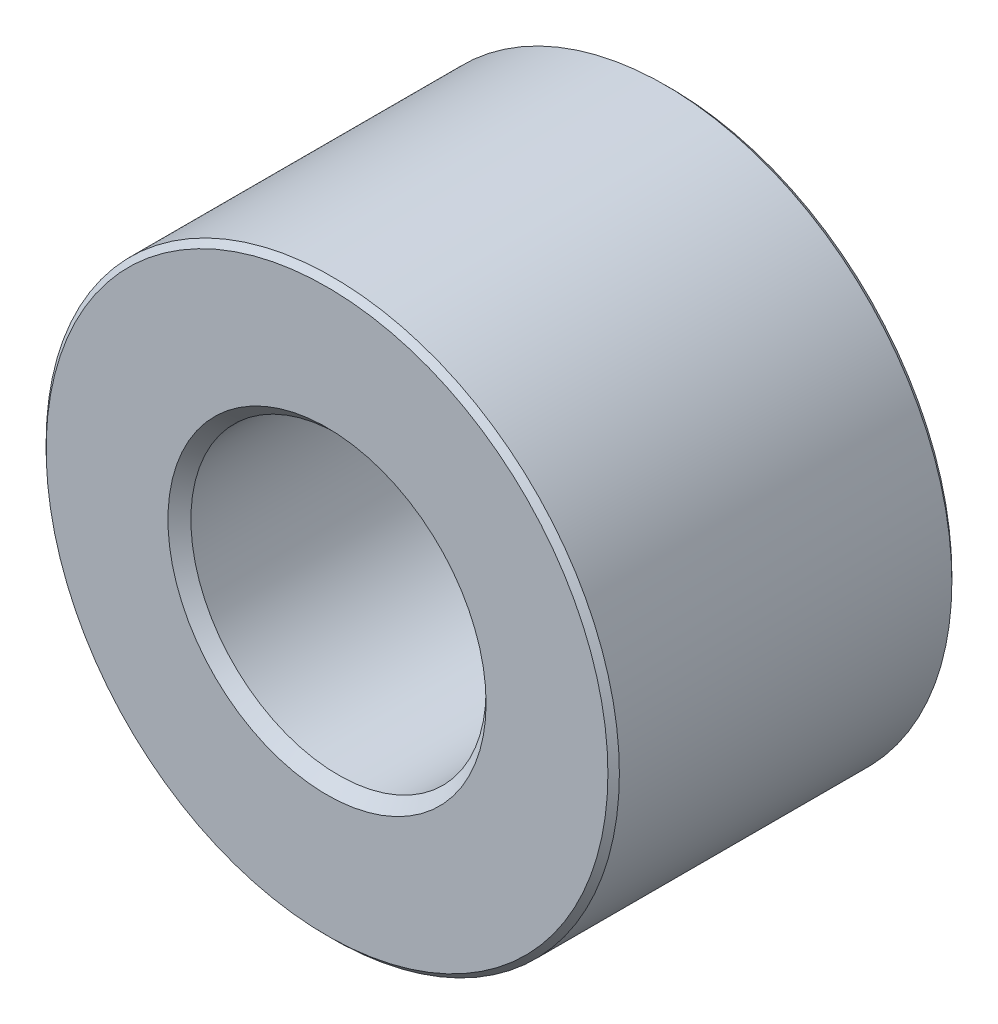
ISO-10303-21;
HEADER;
FILE_DESCRIPTION(('STEP AP214'),'2;1');
FILE_NAME('part.step','',(''),(''),'','','');
FILE_SCHEMA(('AUTOMOTIVE_DESIGN { 1 0 10303 214 1 1 1 1 }'));
ENDSEC;
DATA;
#1=APPLICATION_CONTEXT('core data for automotive mechanical design processes');
#2=APPLICATION_PROTOCOL_DEFINITION('international standard','automotive_design',2000,#1);
#3=PRODUCT_CONTEXT('',#1,'mechanical');
#4=PRODUCT('Part','Part','',(#3));
#5=PRODUCT_RELATED_PRODUCT_CATEGORY('part','',(#4));
#6=PRODUCT_DEFINITION_FORMATION('','',#4);
#7=PRODUCT_DEFINITION_CONTEXT('part definition',#1,'design');
#8=PRODUCT_DEFINITION('design','',#6,#7);
#9=PRODUCT_DEFINITION_SHAPE('','',#8);
#10=(LENGTH_UNIT() NAMED_UNIT(*) SI_UNIT(.MILLI.,.METRE.));
#11=(NAMED_UNIT(*) PLANE_ANGLE_UNIT() SI_UNIT($,.RADIAN.));
#12=(NAMED_UNIT(*) SI_UNIT($,.STERADIAN.) SOLID_ANGLE_UNIT());
#13=UNCERTAINTY_MEASURE_WITH_UNIT(LENGTH_MEASURE(1.E-05),#10,'distance_accuracy_value','');
#14=(GEOMETRIC_REPRESENTATION_CONTEXT(3) GLOBAL_UNCERTAINTY_ASSIGNED_CONTEXT((#13)) GLOBAL_UNIT_ASSIGNED_CONTEXT((#10,
#11,#12)) REPRESENTATION_CONTEXT('',''));
#15=CARTESIAN_POINT('',(0.,0.,0.));
#16=DIRECTION('',(0.,0.,1.));
#17=DIRECTION('',(1.,0.,0.));
#18=AXIS2_PLACEMENT_3D('',#15,#16,#17);
#19=CARTESIAN_POINT('',(0.,0.,6.));
#20=DIRECTION('',(0.,0.,1.));
#21=DIRECTION('',(1.,0.,0.));
#22=AXIS2_PLACEMENT_3D('',#19,#20,#21);
#23=PLANE('',#22);
#24=CARTESIAN_POINT('',(0.,0.,6.));
#25=DIRECTION('',(0.,0.,1.));
#26=DIRECTION('',(1.,0.,0.));
#27=AXIS2_PLACEMENT_3D('',#24,#25,#26);
#28=CIRCLE('',#27,2.775);
#29=CARTESIAN_POINT('',(2.775,0.,6.));
#30=VERTEX_POINT('',#29);
#31=EDGE_CURVE('E8',#30,#30,#28,.F.);
#32=ORIENTED_EDGE('',*,*,#31,.T.);
#33=EDGE_LOOP('',(#32));
#34=FACE_BOUND('',#33,.T.);
#35=CARTESIAN_POINT('',(0.,0.,6.));
#36=DIRECTION('',(0.,0.,1.));
#37=DIRECTION('',(1.,0.,0.));
#38=AXIS2_PLACEMENT_3D('',#35,#36,#37);
#39=CIRCLE('',#38,4.9);
#40=CARTESIAN_POINT('',(4.9,0.,6.));
#41=VERTEX_POINT('',#40);
#42=EDGE_CURVE('E24',#41,#41,#39,.T.);
#43=ORIENTED_EDGE('',*,*,#42,.T.);
#44=EDGE_LOOP('',(#43));
#45=FACE_BOUND('',#44,.T.);
#46=ADVANCED_FACE('F13',(#34,#45),#23,.T.);
#47=CARTESIAN_POINT('',(0.,0.,0.));
#48=DIRECTION('',(0.,0.,1.));
#49=DIRECTION('',(1.,0.,0.));
#50=AXIS2_PLACEMENT_3D('',#47,#48,#49);
#51=PLANE('',#50);
#52=CARTESIAN_POINT('',(0.,0.,0.));
#53=DIRECTION('',(0.,0.,1.));
#54=DIRECTION('',(1.,0.,0.));
#55=AXIS2_PLACEMENT_3D('',#52,#53,#54);
#56=CIRCLE('',#55,4.9);
#57=CARTESIAN_POINT('',(4.9,0.,0.));
#58=VERTEX_POINT('',#57);
#59=EDGE_CURVE('E28',#58,#58,#56,.F.);
#60=ORIENTED_EDGE('',*,*,#59,.T.);
#61=EDGE_LOOP('',(#60));
#62=FACE_BOUND('',#61,.T.);
#63=CARTESIAN_POINT('',(0.,0.,0.));
#64=DIRECTION('',(0.,0.,1.));
#65=DIRECTION('',(1.,0.,0.));
#66=AXIS2_PLACEMENT_3D('',#63,#64,#65);
#67=CIRCLE('',#66,2.575);
#68=CARTESIAN_POINT('',(2.575,0.,0.));
#69=VERTEX_POINT('',#68);
#70=EDGE_CURVE('E39',#69,#69,#67,.T.);
#71=ORIENTED_EDGE('',*,*,#70,.T.);
#72=EDGE_LOOP('',(#71));
#73=FACE_BOUND('',#72,.T.);
#74=ADVANCED_FACE('F43',(#62,#73),#51,.F.);
#75=CARTESIAN_POINT('',(0.,0.,6.));
#76=DIRECTION('',(0.,0.,-1.));
#77=DIRECTION('',(-1.,0.,0.));
#78=AXIS2_PLACEMENT_3D('',#75,#76,#77);
#79=CYLINDRICAL_SURFACE('',#78,5.);
#80=CARTESIAN_POINT('',(0.,0.,0.100000000000002));
#81=DIRECTION('',(0.,0.,1.));
#82=DIRECTION('',(1.,0.,0.));
#83=AXIS2_PLACEMENT_3D('',#80,#81,#82);
#84=CIRCLE('',#83,5.);
#85=CARTESIAN_POINT('',(5.,0.,0.100000000000002));
#86=VERTEX_POINT('',#85);
#87=EDGE_CURVE('E33',#86,#86,#84,.T.);
#88=ORIENTED_EDGE('',*,*,#87,.T.);
#89=EDGE_LOOP('',(#88));
#90=FACE_BOUND('',#89,.T.);
#91=CARTESIAN_POINT('',(0.,0.,5.9));
#92=DIRECTION('',(0.,0.,1.));
#93=DIRECTION('',(1.,0.,0.));
#94=AXIS2_PLACEMENT_3D('',#91,#92,#93);
#95=CIRCLE('',#94,5.);
#96=CARTESIAN_POINT('',(5.,0.,5.9));
#97=VERTEX_POINT('',#96);
#98=EDGE_CURVE('E36',#97,#97,#95,.F.);
#99=ORIENTED_EDGE('',*,*,#98,.T.);
#100=EDGE_LOOP('',(#99));
#101=FACE_BOUND('',#100,.T.);
#102=ADVANCED_FACE('F48',(#90,#101),#79,.T.);
#103=CARTESIAN_POINT('',(0.,0.,6.));
#104=DIRECTION('',(0.,0.,-1.));
#105=DIRECTION('',(-1.,0.,0.));
#106=AXIS2_PLACEMENT_3D('',#103,#104,#105);
#107=CYLINDRICAL_SURFACE('',#106,2.575);
#108=CARTESIAN_POINT('',(0.,0.,5.8));
#109=DIRECTION('',(0.,0.,1.));
#110=DIRECTION('',(1.,0.,0.));
#111=AXIS2_PLACEMENT_3D('',#108,#109,#110);
#112=CIRCLE('',#111,2.575);
#113=CARTESIAN_POINT('',(2.575,0.,5.8));
#114=VERTEX_POINT('',#113);
#115=EDGE_CURVE('E20',#114,#114,#112,.T.);
#116=ORIENTED_EDGE('',*,*,#115,.T.);
#117=EDGE_LOOP('',(#116));
#118=FACE_BOUND('',#117,.T.);
#119=ORIENTED_EDGE('',*,*,#70,.F.);
#120=EDGE_LOOP('',(#119));
#121=FACE_BOUND('',#120,.T.);
#122=ADVANCED_FACE('F45',(#118,#121),#107,.F.);
#123=CARTESIAN_POINT('',(0.,0.,0.100000000000002));
#124=DIRECTION('',(0.,0.,1.));
#125=DIRECTION('',(1.,0.,0.));
#126=AXIS2_PLACEMENT_3D('',#123,#124,#125);
#127=CONICAL_SURFACE('',#126,5.,0.785398163397457);
#128=ORIENTED_EDGE('',*,*,#59,.F.);
#129=EDGE_LOOP('',(#128));
#130=FACE_BOUND('',#129,.T.);
#131=ORIENTED_EDGE('',*,*,#87,.F.);
#132=EDGE_LOOP('',(#131));
#133=FACE_BOUND('',#132,.T.);
#134=ADVANCED_FACE('F47',(#130,#133),#127,.T.);
#135=CARTESIAN_POINT('',(0.,0.,6.));
#136=DIRECTION('',(0.,0.,-1.));
#137=DIRECTION('',(-1.,0.,0.));
#138=AXIS2_PLACEMENT_3D('',#135,#136,#137);
#139=CONICAL_SURFACE('',#138,4.9,0.785398163397461);
#140=ORIENTED_EDGE('',*,*,#98,.F.);
#141=EDGE_LOOP('',(#140));
#142=FACE_BOUND('',#141,.T.);
#143=ORIENTED_EDGE('',*,*,#42,.F.);
#144=EDGE_LOOP('',(#143));
#145=FACE_BOUND('',#144,.T.);
#146=ADVANCED_FACE('F55',(#142,#145),#139,.T.);
#147=CARTESIAN_POINT('',(0.,0.,5.8));
#148=DIRECTION('',(0.,0.,1.));
#149=DIRECTION('',(1.,0.,0.));
#150=AXIS2_PLACEMENT_3D('',#147,#148,#149);
#151=CONICAL_SURFACE('',#150,2.575,0.785398163397454);
#152=ORIENTED_EDGE('',*,*,#31,.F.);
#153=EDGE_LOOP('',(#152));
#154=FACE_BOUND('',#153,.T.);
#155=ORIENTED_EDGE('',*,*,#115,.F.);
#156=EDGE_LOOP('',(#155));
#157=FACE_BOUND('',#156,.T.);
#158=ADVANCED_FACE('F15',(#154,#157),#151,.F.);
#159=CLOSED_SHELL('',(#46,#74,#102,#122,#134,#146,#158));
#160=MANIFOLD_SOLID_BREP('B1',#159);
#161=ADVANCED_BREP_SHAPE_REPRESENTATION('',(#18,#160),#14);
#162=SHAPE_DEFINITION_REPRESENTATION(#9,#161);
ENDSEC;
END-ISO-10303-21;
